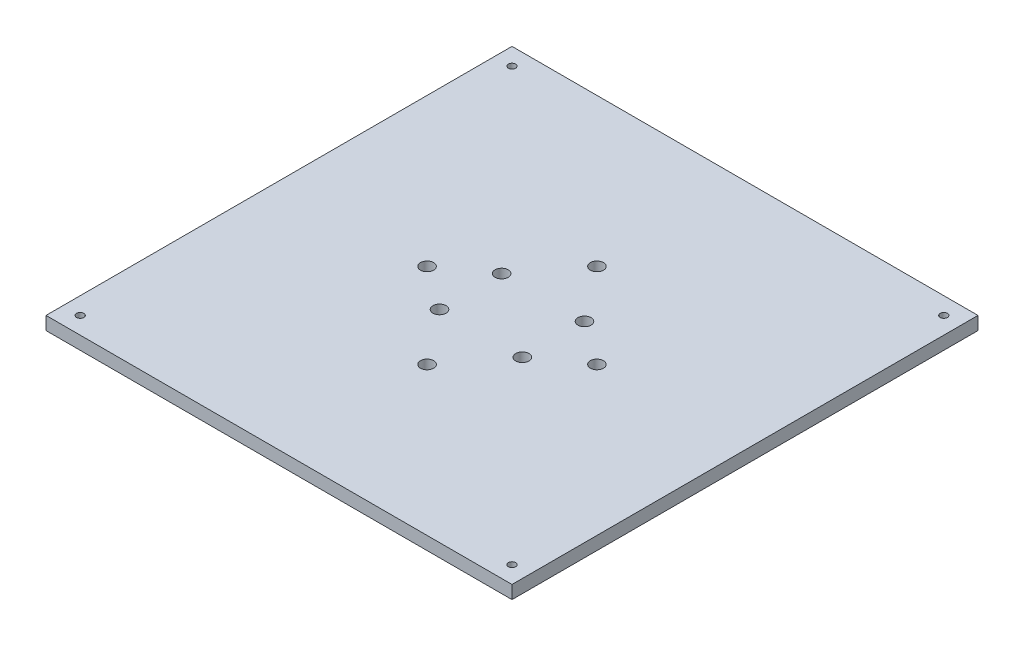
ISO-10303-21;
HEADER;
FILE_DESCRIPTION(('STEP AP214'),'2;1');
FILE_NAME('part.step','',(''),(''),'','','');
FILE_SCHEMA(('AUTOMOTIVE_DESIGN { 1 0 10303 214 1 1 1 1 }'));
ENDSEC;
DATA;
#1=APPLICATION_CONTEXT('core data for automotive mechanical design processes');
#2=APPLICATION_PROTOCOL_DEFINITION('international standard','automotive_design',2000,#1);
#3=PRODUCT_CONTEXT('',#1,'mechanical');
#4=PRODUCT('Part','Part','',(#3));
#5=PRODUCT_RELATED_PRODUCT_CATEGORY('part','',(#4));
#6=PRODUCT_DEFINITION_FORMATION('','',#4);
#7=PRODUCT_DEFINITION_CONTEXT('part definition',#1,'design');
#8=PRODUCT_DEFINITION('design','',#6,#7);
#9=PRODUCT_DEFINITION_SHAPE('','',#8);
#10=(LENGTH_UNIT() NAMED_UNIT(*) SI_UNIT(.MILLI.,.METRE.));
#11=(NAMED_UNIT(*) PLANE_ANGLE_UNIT() SI_UNIT($,.RADIAN.));
#12=(NAMED_UNIT(*) SI_UNIT($,.STERADIAN.) SOLID_ANGLE_UNIT());
#13=UNCERTAINTY_MEASURE_WITH_UNIT(LENGTH_MEASURE(1.E-05),#10,'distance_accuracy_value','');
#14=(GEOMETRIC_REPRESENTATION_CONTEXT(3) GLOBAL_UNCERTAINTY_ASSIGNED_CONTEXT((#13)) GLOBAL_UNIT_ASSIGNED_CONTEXT((#10,
#11,#12)) REPRESENTATION_CONTEXT('',''));
#15=CARTESIAN_POINT('',(0.,0.,0.));
#16=DIRECTION('',(0.,0.,1.));
#17=DIRECTION('',(1.,0.,0.));
#18=AXIS2_PLACEMENT_3D('',#15,#16,#17);
#19=CARTESIAN_POINT('',(0.,6.35,0.));
#20=DIRECTION('',(1.,0.,0.));
#21=DIRECTION('',(0.,0.,-1.));
#22=AXIS2_PLACEMENT_3D('',#19,#20,#21);
#23=PLANE('',#22);
#24=DIRECTION('',(0.,0.,1.));
#25=VECTOR('',#24,1.);
#26=CARTESIAN_POINT('',(0.,0.,0.));
#27=LINE('',#26,#25);
#28=CARTESIAN_POINT('',(0.,0.,-225.));
#29=VERTEX_POINT('',#28);
#30=CARTESIAN_POINT('',(0.,0.,0.));
#31=VERTEX_POINT('',#30);
#32=EDGE_CURVE('E123',#29,#31,#27,.T.);
#33=ORIENTED_EDGE('',*,*,#32,.T.);
#34=DIRECTION('',(0.,-1.,0.));
#35=VECTOR('',#34,1.);
#36=CARTESIAN_POINT('',(0.,6.35,0.));
#37=LINE('',#36,#35);
#38=CARTESIAN_POINT('',(0.,6.35,0.));
#39=VERTEX_POINT('',#38);
#40=EDGE_CURVE('E12',#39,#31,#37,.T.);
#41=ORIENTED_EDGE('',*,*,#40,.F.);
#42=DIRECTION('',(0.,0.,1.));
#43=VECTOR('',#42,1.);
#44=CARTESIAN_POINT('',(0.,6.35,0.));
#45=LINE('',#44,#43);
#46=CARTESIAN_POINT('',(0.,6.35,-225.));
#47=VERTEX_POINT('',#46);
#48=EDGE_CURVE('E90',#47,#39,#45,.T.);
#49=ORIENTED_EDGE('',*,*,#48,.F.);
#50=DIRECTION('',(0.,-1.,0.));
#51=VECTOR('',#50,1.);
#52=CARTESIAN_POINT('',(0.,6.35,-225.));
#53=LINE('',#52,#51);
#54=EDGE_CURVE('E101',#47,#29,#53,.T.);
#55=ORIENTED_EDGE('',*,*,#54,.T.);
#56=EDGE_LOOP('',(#33,#41,#49,#55));
#57=FACE_BOUND('',#56,.T.);
#58=ADVANCED_FACE('F39',(#57),#23,.F.);
#59=CARTESIAN_POINT('',(0.,6.35,0.));
#60=DIRECTION('',(0.,0.,-1.));
#61=DIRECTION('',(-1.,0.,0.));
#62=AXIS2_PLACEMENT_3D('',#59,#60,#61);
#63=PLANE('',#62);
#64=DIRECTION('',(1.,0.,0.));
#65=VECTOR('',#64,1.);
#66=CARTESIAN_POINT('',(0.,0.,0.));
#67=LINE('',#66,#65);
#68=CARTESIAN_POINT('',(225.,0.,0.));
#69=VERTEX_POINT('',#68);
#70=EDGE_CURVE('E95',#31,#69,#67,.T.);
#71=ORIENTED_EDGE('',*,*,#70,.T.);
#72=DIRECTION('',(0.,-1.,0.));
#73=VECTOR('',#72,1.);
#74=CARTESIAN_POINT('',(225.,6.35,0.));
#75=LINE('',#74,#73);
#76=CARTESIAN_POINT('',(225.,6.35,0.));
#77=VERTEX_POINT('',#76);
#78=EDGE_CURVE('E47',#77,#69,#75,.T.);
#79=ORIENTED_EDGE('',*,*,#78,.F.);
#80=DIRECTION('',(1.,0.,0.));
#81=VECTOR('',#80,1.);
#82=CARTESIAN_POINT('',(0.,6.35,0.));
#83=LINE('',#82,#81);
#84=EDGE_CURVE('E85',#39,#77,#83,.T.);
#85=ORIENTED_EDGE('',*,*,#84,.F.);
#86=ORIENTED_EDGE('',*,*,#40,.T.);
#87=EDGE_LOOP('',(#71,#79,#85,#86));
#88=FACE_BOUND('',#87,.T.);
#89=ADVANCED_FACE('F94',(#88),#63,.F.);
#90=CARTESIAN_POINT('',(225.,6.35,0.));
#91=DIRECTION('',(-1.,0.,0.));
#92=DIRECTION('',(0.,0.,1.));
#93=AXIS2_PLACEMENT_3D('',#90,#91,#92);
#94=PLANE('',#93);
#95=DIRECTION('',(0.,0.,-1.));
#96=VECTOR('',#95,1.);
#97=CARTESIAN_POINT('',(225.,0.,0.));
#98=LINE('',#97,#96);
#99=CARTESIAN_POINT('',(225.,0.,-225.));
#100=VERTEX_POINT('',#99);
#101=EDGE_CURVE('E72',#69,#100,#98,.T.);
#102=ORIENTED_EDGE('',*,*,#101,.T.);
#103=DIRECTION('',(0.,-1.,0.));
#104=VECTOR('',#103,1.);
#105=CARTESIAN_POINT('',(225.,6.35,-225.));
#106=LINE('',#105,#104);
#107=CARTESIAN_POINT('',(225.,6.35,-225.));
#108=VERTEX_POINT('',#107);
#109=EDGE_CURVE('E96',#108,#100,#106,.T.);
#110=ORIENTED_EDGE('',*,*,#109,.F.);
#111=DIRECTION('',(0.,0.,-1.));
#112=VECTOR('',#111,1.);
#113=CARTESIAN_POINT('',(225.,6.35,0.));
#114=LINE('',#113,#112);
#115=EDGE_CURVE('E88',#77,#108,#114,.T.);
#116=ORIENTED_EDGE('',*,*,#115,.F.);
#117=ORIENTED_EDGE('',*,*,#78,.T.);
#118=EDGE_LOOP('',(#102,#110,#116,#117));
#119=FACE_BOUND('',#118,.T.);
#120=ADVANCED_FACE('F97',(#119),#94,.F.);
#121=CARTESIAN_POINT('',(0.,6.35,-225.));
#122=DIRECTION('',(0.,0.,1.));
#123=DIRECTION('',(1.,0.,0.));
#124=AXIS2_PLACEMENT_3D('',#121,#122,#123);
#125=PLANE('',#124);
#126=DIRECTION('',(-1.,0.,0.));
#127=VECTOR('',#126,1.);
#128=CARTESIAN_POINT('',(0.,0.,-225.));
#129=LINE('',#128,#127);
#130=EDGE_CURVE('E78',#100,#29,#129,.T.);
#131=ORIENTED_EDGE('',*,*,#130,.T.);
#132=ORIENTED_EDGE('',*,*,#54,.F.);
#133=DIRECTION('',(-1.,0.,0.));
#134=VECTOR('',#133,1.);
#135=CARTESIAN_POINT('',(0.,6.35,-225.));
#136=LINE('',#135,#134);
#137=EDGE_CURVE('E55',#108,#47,#136,.T.);
#138=ORIENTED_EDGE('',*,*,#137,.F.);
#139=ORIENTED_EDGE('',*,*,#109,.T.);
#140=EDGE_LOOP('',(#131,#132,#138,#139));
#141=FACE_BOUND('',#140,.T.);
#142=ADVANCED_FACE('F168',(#141),#125,.F.);
#143=CARTESIAN_POINT('',(0.,6.35,0.));
#144=DIRECTION('',(0.,-1.,0.));
#145=DIRECTION('',(0.,0.,-1.));
#146=AXIS2_PLACEMENT_3D('',#143,#144,#145);
#147=PLANE('',#146);
#148=CARTESIAN_POINT('',(153.509619,6.35,-112.5));
#149=DIRECTION('',(0.,1.,0.));
#150=DIRECTION('',(0.,0.,1.));
#151=AXIS2_PLACEMENT_3D('',#148,#149,#150);
#152=CIRCLE('',#151,3.175);
#153=CARTESIAN_POINT('',(153.509619,6.35,-109.325));
#154=VERTEX_POINT('',#153);
#155=EDGE_CURVE('E347',#154,#154,#152,.T.);
#156=ORIENTED_EDGE('',*,*,#155,.F.);
#157=EDGE_LOOP('',(#156));
#158=FACE_BOUND('',#157,.T.);
#159=CARTESIAN_POINT('',(112.5,6.35,-71.490381));
#160=DIRECTION('',(0.,1.,0.));
#161=DIRECTION('',(0.,0.,1.));
#162=AXIS2_PLACEMENT_3D('',#159,#160,#161);
#163=CIRCLE('',#162,3.175);
#164=CARTESIAN_POINT('',(112.5,6.35,-68.315381));
#165=VERTEX_POINT('',#164);
#166=EDGE_CURVE('E366',#165,#165,#163,.T.);
#167=ORIENTED_EDGE('',*,*,#166,.F.);
#168=EDGE_LOOP('',(#167));
#169=FACE_BOUND('',#168,.T.);
#170=CARTESIAN_POINT('',(112.5,6.35,-153.509619));
#171=DIRECTION('',(0.,1.,0.));
#172=DIRECTION('',(0.,0.,1.));
#173=AXIS2_PLACEMENT_3D('',#170,#171,#172);
#174=CIRCLE('',#173,3.175);
#175=CARTESIAN_POINT('',(112.5,6.35,-150.334619));
#176=VERTEX_POINT('',#175);
#177=EDGE_CURVE('E406',#176,#176,#174,.T.);
#178=ORIENTED_EDGE('',*,*,#177,.F.);
#179=EDGE_LOOP('',(#178));
#180=FACE_BOUND('',#179,.T.);
#181=CARTESIAN_POINT('',(71.490381,6.35,-112.5));
#182=DIRECTION('',(0.,1.,0.));
#183=DIRECTION('',(0.,0.,1.));
#184=AXIS2_PLACEMENT_3D('',#181,#182,#183);
#185=CIRCLE('',#184,3.175);
#186=CARTESIAN_POINT('',(71.490381,6.35,-109.325));
#187=VERTEX_POINT('',#186);
#188=EDGE_CURVE('E399',#187,#187,#185,.T.);
#189=ORIENTED_EDGE('',*,*,#188,.F.);
#190=EDGE_LOOP('',(#189));
#191=FACE_BOUND('',#190,.T.);
#192=CARTESIAN_POINT('',(92.5,6.35,-127.5));
#193=DIRECTION('',(0.,1.,0.));
#194=DIRECTION('',(0.,0.,1.));
#195=AXIS2_PLACEMENT_3D('',#192,#193,#194);
#196=CIRCLE('',#195,3.175);
#197=CARTESIAN_POINT('',(92.5,6.35,-124.325));
#198=VERTEX_POINT('',#197);
#199=EDGE_CURVE('E395',#198,#198,#196,.T.);
#200=ORIENTED_EDGE('',*,*,#199,.F.);
#201=EDGE_LOOP('',(#200));
#202=FACE_BOUND('',#201,.T.);
#203=CARTESIAN_POINT('',(92.5,6.35,-97.5));
#204=DIRECTION('',(0.,1.,0.));
#205=DIRECTION('',(0.,0.,1.));
#206=AXIS2_PLACEMENT_3D('',#203,#204,#205);
#207=CIRCLE('',#206,3.175);
#208=CARTESIAN_POINT('',(92.5,6.35,-94.325));
#209=VERTEX_POINT('',#208);
#210=EDGE_CURVE('E388',#209,#209,#207,.T.);
#211=ORIENTED_EDGE('',*,*,#210,.F.);
#212=EDGE_LOOP('',(#211));
#213=FACE_BOUND('',#212,.T.);
#214=CARTESIAN_POINT('',(132.5,6.35,-97.5));
#215=DIRECTION('',(0.,1.,0.));
#216=DIRECTION('',(0.,0.,1.));
#217=AXIS2_PLACEMENT_3D('',#214,#215,#216);
#218=CIRCLE('',#217,3.175);
#219=CARTESIAN_POINT('',(132.5,6.35,-94.325));
#220=VERTEX_POINT('',#219);
#221=EDGE_CURVE('E381',#220,#220,#218,.T.);
#222=ORIENTED_EDGE('',*,*,#221,.F.);
#223=EDGE_LOOP('',(#222));
#224=FACE_BOUND('',#223,.T.);
#225=CARTESIAN_POINT('',(132.5,6.35,-127.5));
#226=DIRECTION('',(0.,1.,0.));
#227=DIRECTION('',(0.,0.,1.));
#228=AXIS2_PLACEMENT_3D('',#225,#226,#227);
#229=CIRCLE('',#228,3.175);
#230=CARTESIAN_POINT('',(132.5,6.35,-124.325));
#231=VERTEX_POINT('',#230);
#232=EDGE_CURVE('E354',#231,#231,#229,.T.);
#233=ORIENTED_EDGE('',*,*,#232,.F.);
#234=EDGE_LOOP('',(#233));
#235=FACE_BOUND('',#234,.T.);
#236=CARTESIAN_POINT('',(8.25999999999999,6.35,-216.74));
#237=DIRECTION('',(0.,1.,0.));
#238=DIRECTION('',(0.,0.,-1.));
#239=AXIS2_PLACEMENT_3D('',#236,#237,#238);
#240=CIRCLE('',#239,1.75000000000001);
#241=CARTESIAN_POINT('',(8.25999999999999,6.35,-218.49));
#242=VERTEX_POINT('',#241);
#243=EDGE_CURVE('E145',#242,#242,#240,.T.);
#244=ORIENTED_EDGE('',*,*,#243,.F.);
#245=EDGE_LOOP('',(#244));
#246=FACE_BOUND('',#245,.T.);
#247=CARTESIAN_POINT('',(216.74,6.35,-8.26000000000002));
#248=DIRECTION('',(0.,1.,0.));
#249=DIRECTION('',(0.,0.,-1.));
#250=AXIS2_PLACEMENT_3D('',#247,#248,#249);
#251=CIRCLE('',#250,1.75000000000001);
#252=CARTESIAN_POINT('',(216.74,6.35,-10.01));
#253=VERTEX_POINT('',#252);
#254=EDGE_CURVE('E124',#253,#253,#251,.T.);
#255=ORIENTED_EDGE('',*,*,#254,.F.);
#256=EDGE_LOOP('',(#255));
#257=FACE_BOUND('',#256,.T.);
#258=CARTESIAN_POINT('',(8.26000000000002,6.35,-8.25999999999996));
#259=DIRECTION('',(0.,1.,0.));
#260=DIRECTION('',(0.,0.,1.));
#261=AXIS2_PLACEMENT_3D('',#258,#259,#260);
#262=CIRCLE('',#261,1.75000000000001);
#263=CARTESIAN_POINT('',(8.26000000000002,6.35,-6.50999999999995));
#264=VERTEX_POINT('',#263);
#265=EDGE_CURVE('E136',#264,#264,#262,.T.);
#266=ORIENTED_EDGE('',*,*,#265,.F.);
#267=EDGE_LOOP('',(#266));
#268=FACE_BOUND('',#267,.T.);
#269=CARTESIAN_POINT('',(216.74,6.35,-216.74));
#270=DIRECTION('',(0.,1.,0.));
#271=DIRECTION('',(0.,0.,1.));
#272=AXIS2_PLACEMENT_3D('',#269,#270,#271);
#273=CIRCLE('',#272,1.75000000000001);
#274=CARTESIAN_POINT('',(216.74,6.35,-214.99));
#275=VERTEX_POINT('',#274);
#276=EDGE_CURVE('E114',#275,#275,#273,.T.);
#277=ORIENTED_EDGE('',*,*,#276,.F.);
#278=EDGE_LOOP('',(#277));
#279=FACE_BOUND('',#278,.T.);
#280=ORIENTED_EDGE('',*,*,#48,.T.);
#281=ORIENTED_EDGE('',*,*,#84,.T.);
#282=ORIENTED_EDGE('',*,*,#115,.T.);
#283=ORIENTED_EDGE('',*,*,#137,.T.);
#284=EDGE_LOOP('',(#280,#281,#282,#283));
#285=FACE_BOUND('',#284,.T.);
#286=ADVANCED_FACE('F86',(#158,#169,#180,#191,#202,#213,#224,#235,#246,#257,#268,#279,#285),
#147,.F.);
#287=CARTESIAN_POINT('',(0.,0.,0.));
#288=DIRECTION('',(0.,-1.,0.));
#289=DIRECTION('',(0.,0.,-1.));
#290=AXIS2_PLACEMENT_3D('',#287,#288,#289);
#291=PLANE('',#290);
#292=CARTESIAN_POINT('',(153.509619,0.,-112.5));
#293=DIRECTION('',(0.,1.,0.));
#294=DIRECTION('',(0.,0.,1.));
#295=AXIS2_PLACEMENT_3D('',#292,#293,#294);
#296=CIRCLE('',#295,3.175);
#297=CARTESIAN_POINT('',(153.509619,0.,-109.325));
#298=VERTEX_POINT('',#297);
#299=EDGE_CURVE('E142',#298,#298,#296,.T.);
#300=ORIENTED_EDGE('',*,*,#299,.T.);
#301=EDGE_LOOP('',(#300));
#302=FACE_BOUND('',#301,.T.);
#303=CARTESIAN_POINT('',(112.5,0.,-71.490381));
#304=DIRECTION('',(0.,1.,0.));
#305=DIRECTION('',(0.,0.,1.));
#306=AXIS2_PLACEMENT_3D('',#303,#304,#305);
#307=CIRCLE('',#306,3.175);
#308=CARTESIAN_POINT('',(112.5,0.,-68.315381));
#309=VERTEX_POINT('',#308);
#310=EDGE_CURVE('E370',#309,#309,#307,.T.);
#311=ORIENTED_EDGE('',*,*,#310,.T.);
#312=EDGE_LOOP('',(#311));
#313=FACE_BOUND('',#312,.T.);
#314=CARTESIAN_POINT('',(112.5,0.,-153.509619));
#315=DIRECTION('',(0.,1.,0.));
#316=DIRECTION('',(0.,0.,1.));
#317=AXIS2_PLACEMENT_3D('',#314,#315,#316);
#318=CIRCLE('',#317,3.175);
#319=CARTESIAN_POINT('',(112.5,0.,-150.334619));
#320=VERTEX_POINT('',#319);
#321=EDGE_CURVE('E404',#320,#320,#318,.T.);
#322=ORIENTED_EDGE('',*,*,#321,.T.);
#323=EDGE_LOOP('',(#322));
#324=FACE_BOUND('',#323,.T.);
#325=CARTESIAN_POINT('',(71.490381,0.,-112.5));
#326=DIRECTION('',(0.,1.,0.));
#327=DIRECTION('',(0.,0.,1.));
#328=AXIS2_PLACEMENT_3D('',#325,#326,#327);
#329=CIRCLE('',#328,3.175);
#330=CARTESIAN_POINT('',(71.490381,0.,-109.325));
#331=VERTEX_POINT('',#330);
#332=EDGE_CURVE('E358',#331,#331,#329,.T.);
#333=ORIENTED_EDGE('',*,*,#332,.T.);
#334=EDGE_LOOP('',(#333));
#335=FACE_BOUND('',#334,.T.);
#336=CARTESIAN_POINT('',(92.5,0.,-127.5));
#337=DIRECTION('',(0.,1.,0.));
#338=DIRECTION('',(0.,0.,1.));
#339=AXIS2_PLACEMENT_3D('',#336,#337,#338);
#340=CIRCLE('',#339,3.175);
#341=CARTESIAN_POINT('',(92.5,0.,-124.325));
#342=VERTEX_POINT('',#341);
#343=EDGE_CURVE('E393',#342,#342,#340,.T.);
#344=ORIENTED_EDGE('',*,*,#343,.T.);
#345=EDGE_LOOP('',(#344));
#346=FACE_BOUND('',#345,.T.);
#347=CARTESIAN_POINT('',(92.5,0.,-97.5));
#348=DIRECTION('',(0.,1.,0.));
#349=DIRECTION('',(0.,0.,1.));
#350=AXIS2_PLACEMENT_3D('',#347,#348,#349);
#351=CIRCLE('',#350,3.175);
#352=CARTESIAN_POINT('',(92.5,0.,-94.325));
#353=VERTEX_POINT('',#352);
#354=EDGE_CURVE('E386',#353,#353,#351,.T.);
#355=ORIENTED_EDGE('',*,*,#354,.T.);
#356=EDGE_LOOP('',(#355));
#357=FACE_BOUND('',#356,.T.);
#358=CARTESIAN_POINT('',(132.5,0.,-97.5));
#359=DIRECTION('',(0.,1.,0.));
#360=DIRECTION('',(0.,0.,1.));
#361=AXIS2_PLACEMENT_3D('',#358,#359,#360);
#362=CIRCLE('',#361,3.175);
#363=CARTESIAN_POINT('',(132.5,0.,-94.325));
#364=VERTEX_POINT('',#363);
#365=EDGE_CURVE('E375',#364,#364,#362,.T.);
#366=ORIENTED_EDGE('',*,*,#365,.T.);
#367=EDGE_LOOP('',(#366));
#368=FACE_BOUND('',#367,.T.);
#369=CARTESIAN_POINT('',(132.5,0.,-127.5));
#370=DIRECTION('',(0.,1.,0.));
#371=DIRECTION('',(0.,0.,1.));
#372=AXIS2_PLACEMENT_3D('',#369,#370,#371);
#373=CIRCLE('',#372,3.175);
#374=CARTESIAN_POINT('',(132.5,0.,-124.325));
#375=VERTEX_POINT('',#374);
#376=EDGE_CURVE('E349',#375,#375,#373,.T.);
#377=ORIENTED_EDGE('',*,*,#376,.T.);
#378=EDGE_LOOP('',(#377));
#379=FACE_BOUND('',#378,.T.);
#380=CARTESIAN_POINT('',(8.25999999999999,0.,-216.74));
#381=DIRECTION('',(0.,1.,0.));
#382=DIRECTION('',(0.,0.,-1.));
#383=AXIS2_PLACEMENT_3D('',#380,#381,#382);
#384=CIRCLE('',#383,1.75000000000001);
#385=CARTESIAN_POINT('',(8.25999999999999,0.,-218.49));
#386=VERTEX_POINT('',#385);
#387=EDGE_CURVE('E120',#386,#386,#384,.T.);
#388=ORIENTED_EDGE('',*,*,#387,.T.);
#389=EDGE_LOOP('',(#388));
#390=FACE_BOUND('',#389,.T.);
#391=CARTESIAN_POINT('',(216.74,0.,-8.26000000000002));
#392=DIRECTION('',(0.,1.,0.));
#393=DIRECTION('',(0.,0.,-1.));
#394=AXIS2_PLACEMENT_3D('',#391,#392,#393);
#395=CIRCLE('',#394,1.75000000000001);
#396=CARTESIAN_POINT('',(216.74,0.,-10.01));
#397=VERTEX_POINT('',#396);
#398=EDGE_CURVE('E129',#397,#397,#395,.T.);
#399=ORIENTED_EDGE('',*,*,#398,.T.);
#400=EDGE_LOOP('',(#399));
#401=FACE_BOUND('',#400,.T.);
#402=CARTESIAN_POINT('',(8.26000000000002,0.,-8.25999999999996));
#403=DIRECTION('',(0.,1.,0.));
#404=DIRECTION('',(0.,0.,1.));
#405=AXIS2_PLACEMENT_3D('',#402,#403,#404);
#406=CIRCLE('',#405,1.75000000000001);
#407=CARTESIAN_POINT('',(8.26000000000002,0.,-6.50999999999995));
#408=VERTEX_POINT('',#407);
#409=EDGE_CURVE('E130',#408,#408,#406,.T.);
#410=ORIENTED_EDGE('',*,*,#409,.T.);
#411=EDGE_LOOP('',(#410));
#412=FACE_BOUND('',#411,.T.);
#413=CARTESIAN_POINT('',(216.74,0.,-216.74));
#414=DIRECTION('',(0.,1.,0.));
#415=DIRECTION('',(0.,0.,1.));
#416=AXIS2_PLACEMENT_3D('',#413,#414,#415);
#417=CIRCLE('',#416,1.75000000000001);
#418=CARTESIAN_POINT('',(216.74,0.,-214.99));
#419=VERTEX_POINT('',#418);
#420=EDGE_CURVE('E119',#419,#419,#417,.T.);
#421=ORIENTED_EDGE('',*,*,#420,.T.);
#422=EDGE_LOOP('',(#421));
#423=FACE_BOUND('',#422,.T.);
#424=ORIENTED_EDGE('',*,*,#32,.F.);
#425=ORIENTED_EDGE('',*,*,#130,.F.);
#426=ORIENTED_EDGE('',*,*,#101,.F.);
#427=ORIENTED_EDGE('',*,*,#70,.F.);
#428=EDGE_LOOP('',(#424,#425,#426,#427));
#429=FACE_BOUND('',#428,.T.);
#430=ADVANCED_FACE('F155',(#302,#313,#324,#335,#346,#357,#368,#379,#390,#401,#412,#423,#429),
#291,.T.);
#431=CARTESIAN_POINT('',(216.74,0.,-216.74));
#432=DIRECTION('',(0.,1.,0.));
#433=DIRECTION('',(0.,0.,1.));
#434=AXIS2_PLACEMENT_3D('',#431,#432,#433);
#435=CYLINDRICAL_SURFACE('',#434,1.75000000000001);
#436=ORIENTED_EDGE('',*,*,#420,.F.);
#437=EDGE_LOOP('',(#436));
#438=FACE_BOUND('',#437,.T.);
#439=ORIENTED_EDGE('',*,*,#276,.T.);
#440=EDGE_LOOP('',(#439));
#441=FACE_BOUND('',#440,.T.);
#442=ADVANCED_FACE('F175',(#438,#441),#435,.F.);
#443=CARTESIAN_POINT('',(8.26000000000002,0.,-8.25999999999996));
#444=DIRECTION('',(0.,1.,0.));
#445=DIRECTION('',(0.,0.,1.));
#446=AXIS2_PLACEMENT_3D('',#443,#444,#445);
#447=CYLINDRICAL_SURFACE('',#446,1.75000000000001);
#448=ORIENTED_EDGE('',*,*,#409,.F.);
#449=EDGE_LOOP('',(#448));
#450=FACE_BOUND('',#449,.T.);
#451=ORIENTED_EDGE('',*,*,#265,.T.);
#452=EDGE_LOOP('',(#451));
#453=FACE_BOUND('',#452,.T.);
#454=ADVANCED_FACE('F162',(#450,#453),#447,.F.);
#455=CARTESIAN_POINT('',(216.74,0.,-8.26000000000002));
#456=DIRECTION('',(0.,1.,0.));
#457=DIRECTION('',(0.,0.,1.));
#458=AXIS2_PLACEMENT_3D('',#455,#456,#457);
#459=CYLINDRICAL_SURFACE('',#458,1.75000000000001);
#460=ORIENTED_EDGE('',*,*,#398,.F.);
#461=EDGE_LOOP('',(#460));
#462=FACE_BOUND('',#461,.T.);
#463=ORIENTED_EDGE('',*,*,#254,.T.);
#464=EDGE_LOOP('',(#463));
#465=FACE_BOUND('',#464,.T.);
#466=ADVANCED_FACE('F158',(#462,#465),#459,.F.);
#467=CARTESIAN_POINT('',(8.25999999999999,0.,-216.74));
#468=DIRECTION('',(0.,1.,0.));
#469=DIRECTION('',(0.,0.,1.));
#470=AXIS2_PLACEMENT_3D('',#467,#468,#469);
#471=CYLINDRICAL_SURFACE('',#470,1.75000000000001);
#472=ORIENTED_EDGE('',*,*,#387,.F.);
#473=EDGE_LOOP('',(#472));
#474=FACE_BOUND('',#473,.T.);
#475=ORIENTED_EDGE('',*,*,#243,.T.);
#476=EDGE_LOOP('',(#475));
#477=FACE_BOUND('',#476,.T.);
#478=ADVANCED_FACE('F161',(#474,#477),#471,.F.);
#479=CARTESIAN_POINT('',(132.5,0.,-127.5));
#480=DIRECTION('',(0.,1.,0.));
#481=DIRECTION('',(0.,0.,1.));
#482=AXIS2_PLACEMENT_3D('',#479,#480,#481);
#483=CYLINDRICAL_SURFACE('',#482,3.175);
#484=ORIENTED_EDGE('',*,*,#376,.F.);
#485=EDGE_LOOP('',(#484));
#486=FACE_BOUND('',#485,.T.);
#487=ORIENTED_EDGE('',*,*,#232,.T.);
#488=EDGE_LOOP('',(#487));
#489=FACE_BOUND('',#488,.T.);
#490=ADVANCED_FACE('F258',(#486,#489),#483,.F.);
#491=CARTESIAN_POINT('',(132.5,0.,-97.5));
#492=DIRECTION('',(0.,1.,0.));
#493=DIRECTION('',(0.,0.,1.));
#494=AXIS2_PLACEMENT_3D('',#491,#492,#493);
#495=CYLINDRICAL_SURFACE('',#494,3.175);
#496=ORIENTED_EDGE('',*,*,#365,.F.);
#497=EDGE_LOOP('',(#496));
#498=FACE_BOUND('',#497,.T.);
#499=ORIENTED_EDGE('',*,*,#221,.T.);
#500=EDGE_LOOP('',(#499));
#501=FACE_BOUND('',#500,.T.);
#502=ADVANCED_FACE('F266',(#498,#501),#495,.F.);
#503=CARTESIAN_POINT('',(92.5,0.,-97.5));
#504=DIRECTION('',(0.,1.,0.));
#505=DIRECTION('',(0.,0.,1.));
#506=AXIS2_PLACEMENT_3D('',#503,#504,#505);
#507=CYLINDRICAL_SURFACE('',#506,3.175);
#508=ORIENTED_EDGE('',*,*,#354,.F.);
#509=EDGE_LOOP('',(#508));
#510=FACE_BOUND('',#509,.T.);
#511=ORIENTED_EDGE('',*,*,#210,.T.);
#512=EDGE_LOOP('',(#511));
#513=FACE_BOUND('',#512,.T.);
#514=ADVANCED_FACE('F275',(#510,#513),#507,.F.);
#515=CARTESIAN_POINT('',(92.5,0.,-127.5));
#516=DIRECTION('',(0.,1.,0.));
#517=DIRECTION('',(0.,0.,1.));
#518=AXIS2_PLACEMENT_3D('',#515,#516,#517);
#519=CYLINDRICAL_SURFACE('',#518,3.175);
#520=ORIENTED_EDGE('',*,*,#343,.F.);
#521=EDGE_LOOP('',(#520));
#522=FACE_BOUND('',#521,.T.);
#523=ORIENTED_EDGE('',*,*,#199,.T.);
#524=EDGE_LOOP('',(#523));
#525=FACE_BOUND('',#524,.T.);
#526=ADVANCED_FACE('F284',(#522,#525),#519,.F.);
#527=CARTESIAN_POINT('',(71.490381,0.,-112.5));
#528=DIRECTION('',(0.,1.,0.));
#529=DIRECTION('',(0.,0.,1.));
#530=AXIS2_PLACEMENT_3D('',#527,#528,#529);
#531=CYLINDRICAL_SURFACE('',#530,3.175);
#532=ORIENTED_EDGE('',*,*,#332,.F.);
#533=EDGE_LOOP('',(#532));
#534=FACE_BOUND('',#533,.T.);
#535=ORIENTED_EDGE('',*,*,#188,.T.);
#536=EDGE_LOOP('',(#535));
#537=FACE_BOUND('',#536,.T.);
#538=ADVANCED_FACE('F293',(#534,#537),#531,.F.);
#539=CARTESIAN_POINT('',(112.5,0.,-153.509619));
#540=DIRECTION('',(0.,1.,0.));
#541=DIRECTION('',(0.,0.,1.));
#542=AXIS2_PLACEMENT_3D('',#539,#540,#541);
#543=CYLINDRICAL_SURFACE('',#542,3.175);
#544=ORIENTED_EDGE('',*,*,#321,.F.);
#545=EDGE_LOOP('',(#544));
#546=FACE_BOUND('',#545,.T.);
#547=ORIENTED_EDGE('',*,*,#177,.T.);
#548=EDGE_LOOP('',(#547));
#549=FACE_BOUND('',#548,.T.);
#550=ADVANCED_FACE('F302',(#546,#549),#543,.F.);
#551=CARTESIAN_POINT('',(112.5,0.,-71.490381));
#552=DIRECTION('',(0.,1.,0.));
#553=DIRECTION('',(0.,0.,1.));
#554=AXIS2_PLACEMENT_3D('',#551,#552,#553);
#555=CYLINDRICAL_SURFACE('',#554,3.175);
#556=ORIENTED_EDGE('',*,*,#310,.F.);
#557=EDGE_LOOP('',(#556));
#558=FACE_BOUND('',#557,.T.);
#559=ORIENTED_EDGE('',*,*,#166,.T.);
#560=EDGE_LOOP('',(#559));
#561=FACE_BOUND('',#560,.T.);
#562=ADVANCED_FACE('F311',(#558,#561),#555,.F.);
#563=CARTESIAN_POINT('',(153.509619,0.,-112.5));
#564=DIRECTION('',(0.,1.,0.));
#565=DIRECTION('',(0.,0.,1.));
#566=AXIS2_PLACEMENT_3D('',#563,#564,#565);
#567=CYLINDRICAL_SURFACE('',#566,3.175);
#568=ORIENTED_EDGE('',*,*,#299,.F.);
#569=EDGE_LOOP('',(#568));
#570=FACE_BOUND('',#569,.T.);
#571=ORIENTED_EDGE('',*,*,#155,.T.);
#572=EDGE_LOOP('',(#571));
#573=FACE_BOUND('',#572,.T.);
#574=ADVANCED_FACE('F320',(#570,#573),#567,.F.);
#575=CLOSED_SHELL('',(#58,#89,#120,#142,#286,#430,#442,#454,#466,#478,#490,#502,#514,#526,#538,
#550,#562,#574));
#576=MANIFOLD_SOLID_BREP('B2',#575);
#577=ADVANCED_BREP_SHAPE_REPRESENTATION('',(#18,#576),#14);
#578=SHAPE_DEFINITION_REPRESENTATION(#9,#577);
ENDSEC;
END-ISO-10303-21;
